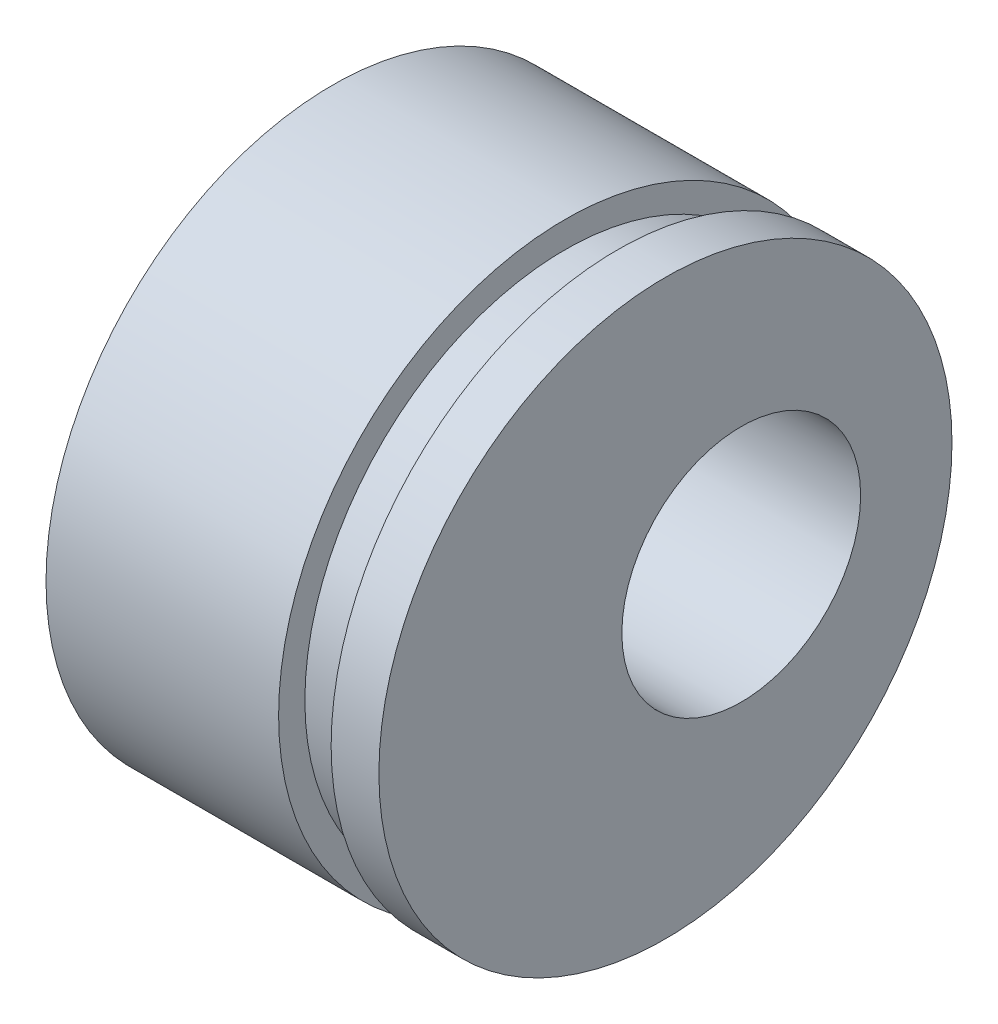
ISO-10303-21;
HEADER;
FILE_DESCRIPTION(('STEP AP214'),'2;1');
FILE_NAME('part.step','',(''),(''),'','','');
FILE_SCHEMA(('AUTOMOTIVE_DESIGN { 1 0 10303 214 1 1 1 1 }'));
ENDSEC;
DATA;
#1=APPLICATION_CONTEXT('core data for automotive mechanical design processes');
#2=APPLICATION_PROTOCOL_DEFINITION('international standard','automotive_design',2000,#1);
#3=PRODUCT_CONTEXT('',#1,'mechanical');
#4=PRODUCT('Part','Part','',(#3));
#5=PRODUCT_RELATED_PRODUCT_CATEGORY('part','',(#4));
#6=PRODUCT_DEFINITION_FORMATION('','',#4);
#7=PRODUCT_DEFINITION_CONTEXT('part definition',#1,'design');
#8=PRODUCT_DEFINITION('design','',#6,#7);
#9=PRODUCT_DEFINITION_SHAPE('','',#8);
#10=(LENGTH_UNIT() NAMED_UNIT(*) SI_UNIT(.MILLI.,.METRE.));
#11=(NAMED_UNIT(*) PLANE_ANGLE_UNIT() SI_UNIT($,.RADIAN.));
#12=(NAMED_UNIT(*) SI_UNIT($,.STERADIAN.) SOLID_ANGLE_UNIT());
#13=UNCERTAINTY_MEASURE_WITH_UNIT(LENGTH_MEASURE(1.E-05),#10,'distance_accuracy_value','');
#14=(GEOMETRIC_REPRESENTATION_CONTEXT(3) GLOBAL_UNCERTAINTY_ASSIGNED_CONTEXT((#13)) GLOBAL_UNIT_ASSIGNED_CONTEXT((#10,
#11,#12)) REPRESENTATION_CONTEXT('',''));
#15=CARTESIAN_POINT('',(0.,0.,0.));
#16=DIRECTION('',(0.,0.,1.));
#17=DIRECTION('',(1.,0.,0.));
#18=AXIS2_PLACEMENT_3D('',#15,#16,#17);
#19=CARTESIAN_POINT('',(6.009399716,0.,0.));
#20=DIRECTION('',(-1.,0.,0.));
#21=DIRECTION('',(0.,0.,1.));
#22=AXIS2_PLACEMENT_3D('',#19,#20,#21);
#23=CYLINDRICAL_SURFACE('',#22,5.999999938);
#24=CARTESIAN_POINT('',(11.979399714,0.,0.));
#25=DIRECTION('',(-1.,0.,0.));
#26=DIRECTION('',(0.,0.,1.));
#27=AXIS2_PLACEMENT_3D('',#24,#25,#26);
#28=CIRCLE('',#27,5.999999938);
#29=CARTESIAN_POINT('',(11.979399714,0.,5.999999938));
#30=VERTEX_POINT('',#29);
#31=EDGE_CURVE('E41',#30,#30,#28,.T.);
#32=ORIENTED_EDGE('',*,*,#31,.F.);
#33=EDGE_LOOP('',(#32));
#34=FACE_BOUND('',#33,.T.);
#35=CARTESIAN_POINT('',(12.979399746,0.,0.));
#36=DIRECTION('',(-1.,0.,0.));
#37=DIRECTION('',(0.,0.,1.));
#38=AXIS2_PLACEMENT_3D('',#35,#36,#37);
#39=CIRCLE('',#38,5.999999938);
#40=CARTESIAN_POINT('',(12.979399746,0.,5.999999938));
#41=VERTEX_POINT('',#40);
#42=EDGE_CURVE('E10',#41,#41,#39,.T.);
#43=ORIENTED_EDGE('',*,*,#42,.T.);
#44=EDGE_LOOP('',(#43));
#45=FACE_BOUND('',#44,.T.);
#46=ADVANCED_FACE('F35',(#34,#45),#23,.T.);
#47=CARTESIAN_POINT('',(11.979399714,5.999999938,0.));
#48=DIRECTION('',(1.,0.,0.));
#49=DIRECTION('',(0.,0.,-1.));
#50=AXIS2_PLACEMENT_3D('',#47,#48,#49);
#51=PLANE('',#50);
#52=CARTESIAN_POINT('',(11.979399714,0.,0.));
#53=DIRECTION('',(-1.,0.,0.));
#54=DIRECTION('',(0.,0.,1.));
#55=AXIS2_PLACEMENT_3D('',#52,#53,#54);
#56=CIRCLE('',#55,5.450000022);
#57=CARTESIAN_POINT('',(11.979399714,0.,5.450000022));
#58=VERTEX_POINT('',#57);
#59=EDGE_CURVE('E45',#58,#58,#56,.T.);
#60=ORIENTED_EDGE('',*,*,#59,.F.);
#61=EDGE_LOOP('',(#60));
#62=FACE_BOUND('',#61,.T.);
#63=ORIENTED_EDGE('',*,*,#31,.T.);
#64=EDGE_LOOP('',(#63));
#65=FACE_BOUND('',#64,.T.);
#66=ADVANCED_FACE('F84',(#62,#65),#51,.F.);
#67=CARTESIAN_POINT('',(6.009399716,0.,0.));
#68=DIRECTION('',(-1.,0.,0.));
#69=DIRECTION('',(0.,0.,1.));
#70=AXIS2_PLACEMENT_3D('',#67,#68,#69);
#71=CYLINDRICAL_SURFACE('',#70,5.450000022);
#72=CARTESIAN_POINT('',(10.879399628,0.,0.));
#73=DIRECTION('',(-1.,0.,0.));
#74=DIRECTION('',(0.,0.,1.));
#75=AXIS2_PLACEMENT_3D('',#72,#73,#74);
#76=CIRCLE('',#75,5.450000022);
#77=CARTESIAN_POINT('',(10.879399628,0.,5.450000022));
#78=VERTEX_POINT('',#77);
#79=EDGE_CURVE('E49',#78,#78,#76,.T.);
#80=ORIENTED_EDGE('',*,*,#79,.F.);
#81=EDGE_LOOP('',(#80));
#82=FACE_BOUND('',#81,.T.);
#83=ORIENTED_EDGE('',*,*,#59,.T.);
#84=EDGE_LOOP('',(#83));
#85=FACE_BOUND('',#84,.T.);
#86=ADVANCED_FACE('F89',(#82,#85),#71,.T.);
#87=CARTESIAN_POINT('',(10.879399628,5.999999938,0.));
#88=DIRECTION('',(-1.,0.,0.));
#89=DIRECTION('',(0.,0.,1.));
#90=AXIS2_PLACEMENT_3D('',#87,#88,#89);
#91=PLANE('',#90);
#92=CARTESIAN_POINT('',(10.879399628,0.,0.));
#93=DIRECTION('',(-1.,0.,0.));
#94=DIRECTION('',(0.,0.,1.));
#95=AXIS2_PLACEMENT_3D('',#92,#93,#94);
#96=CIRCLE('',#95,5.999999938);
#97=CARTESIAN_POINT('',(10.879399628,0.,5.999999938));
#98=VERTEX_POINT('',#97);
#99=EDGE_CURVE('E54',#98,#98,#96,.T.);
#100=ORIENTED_EDGE('',*,*,#99,.F.);
#101=EDGE_LOOP('',(#100));
#102=FACE_BOUND('',#101,.T.);
#103=ORIENTED_EDGE('',*,*,#79,.T.);
#104=EDGE_LOOP('',(#103));
#105=FACE_BOUND('',#104,.T.);
#106=ADVANCED_FACE('F94',(#102,#105),#91,.F.);
#107=CARTESIAN_POINT('',(6.009399716,0.,0.));
#108=DIRECTION('',(-1.,0.,0.));
#109=DIRECTION('',(0.,0.,1.));
#110=AXIS2_PLACEMENT_3D('',#107,#108,#109);
#111=CYLINDRICAL_SURFACE('',#110,5.999999938);
#112=CARTESIAN_POINT('',(6.009399716,0.,0.));
#113=DIRECTION('',(-1.,0.,0.));
#114=DIRECTION('',(0.,0.,1.));
#115=AXIS2_PLACEMENT_3D('',#112,#113,#114);
#116=CIRCLE('',#115,5.999999938);
#117=CARTESIAN_POINT('',(6.009399716,0.,5.999999938));
#118=VERTEX_POINT('',#117);
#119=EDGE_CURVE('E57',#118,#118,#116,.T.);
#120=ORIENTED_EDGE('',*,*,#119,.F.);
#121=EDGE_LOOP('',(#120));
#122=FACE_BOUND('',#121,.T.);
#123=ORIENTED_EDGE('',*,*,#99,.T.);
#124=EDGE_LOOP('',(#123));
#125=FACE_BOUND('',#124,.T.);
#126=ADVANCED_FACE('F80',(#122,#125),#111,.T.);
#127=CARTESIAN_POINT('',(6.009399716,2.499999953,0.));
#128=DIRECTION('',(1.,0.,0.));
#129=DIRECTION('',(0.,0.,-1.));
#130=AXIS2_PLACEMENT_3D('',#127,#128,#129);
#131=PLANE('',#130);
#132=CARTESIAN_POINT('',(6.009399716,0.,-1.5875));
#133=DIRECTION('',(1.,0.,0.));
#134=DIRECTION('',(0.,0.,-1.));
#135=AXIS2_PLACEMENT_3D('',#132,#133,#134);
#136=CIRCLE('',#135,2.499999953);
#137=CARTESIAN_POINT('',(6.009399716,0.,-4.087499953));
#138=VERTEX_POINT('',#137);
#139=EDGE_CURVE('E60',#138,#138,#136,.F.);
#140=ORIENTED_EDGE('',*,*,#139,.F.);
#141=EDGE_LOOP('',(#140));
#142=FACE_BOUND('',#141,.T.);
#143=ORIENTED_EDGE('',*,*,#119,.T.);
#144=EDGE_LOOP('',(#143));
#145=FACE_BOUND('',#144,.T.);
#146=ADVANCED_FACE('F73',(#142,#145),#131,.F.);
#147=CARTESIAN_POINT('',(12.979399746,2.999999969,0.));
#148=DIRECTION('',(-1.,0.,0.));
#149=DIRECTION('',(0.,0.,1.));
#150=AXIS2_PLACEMENT_3D('',#147,#148,#149);
#151=PLANE('',#150);
#152=CARTESIAN_POINT('',(12.979399746,0.,-1.5875));
#153=DIRECTION('',(1.,0.,0.));
#154=DIRECTION('',(0.,0.,-1.));
#155=AXIS2_PLACEMENT_3D('',#152,#153,#154);
#156=CIRCLE('',#155,2.499999953);
#157=CARTESIAN_POINT('',(12.979399746,0.,-4.087499953));
#158=VERTEX_POINT('',#157);
#159=EDGE_CURVE('E63',#158,#158,#156,.T.);
#160=ORIENTED_EDGE('',*,*,#159,.F.);
#161=EDGE_LOOP('',(#160));
#162=FACE_BOUND('',#161,.T.);
#163=ORIENTED_EDGE('',*,*,#42,.F.);
#164=EDGE_LOOP('',(#163));
#165=FACE_BOUND('',#164,.T.);
#166=ADVANCED_FACE('F70',(#162,#165),#151,.F.);
#167=CARTESIAN_POINT('',(12.979399746,0.,-1.5875));
#168=DIRECTION('',(-1.,0.,0.));
#169=DIRECTION('',(0.,0.,1.));
#170=AXIS2_PLACEMENT_3D('',#167,#168,#169);
#171=CYLINDRICAL_SURFACE('',#170,2.499999953);
#172=ORIENTED_EDGE('',*,*,#159,.T.);
#173=EDGE_LOOP('',(#172));
#174=FACE_BOUND('',#173,.T.);
#175=ORIENTED_EDGE('',*,*,#139,.T.);
#176=EDGE_LOOP('',(#175));
#177=FACE_BOUND('',#176,.T.);
#178=ADVANCED_FACE('F67',(#174,#177),#171,.F.);
#179=CLOSED_SHELL('',(#46,#66,#86,#106,#126,#146,#166,#178));
#180=MANIFOLD_SOLID_BREP('B2',#179);
#181=ADVANCED_BREP_SHAPE_REPRESENTATION('',(#18,#180),#14);
#182=SHAPE_DEFINITION_REPRESENTATION(#9,#181);
ENDSEC;
END-ISO-10303-21;
